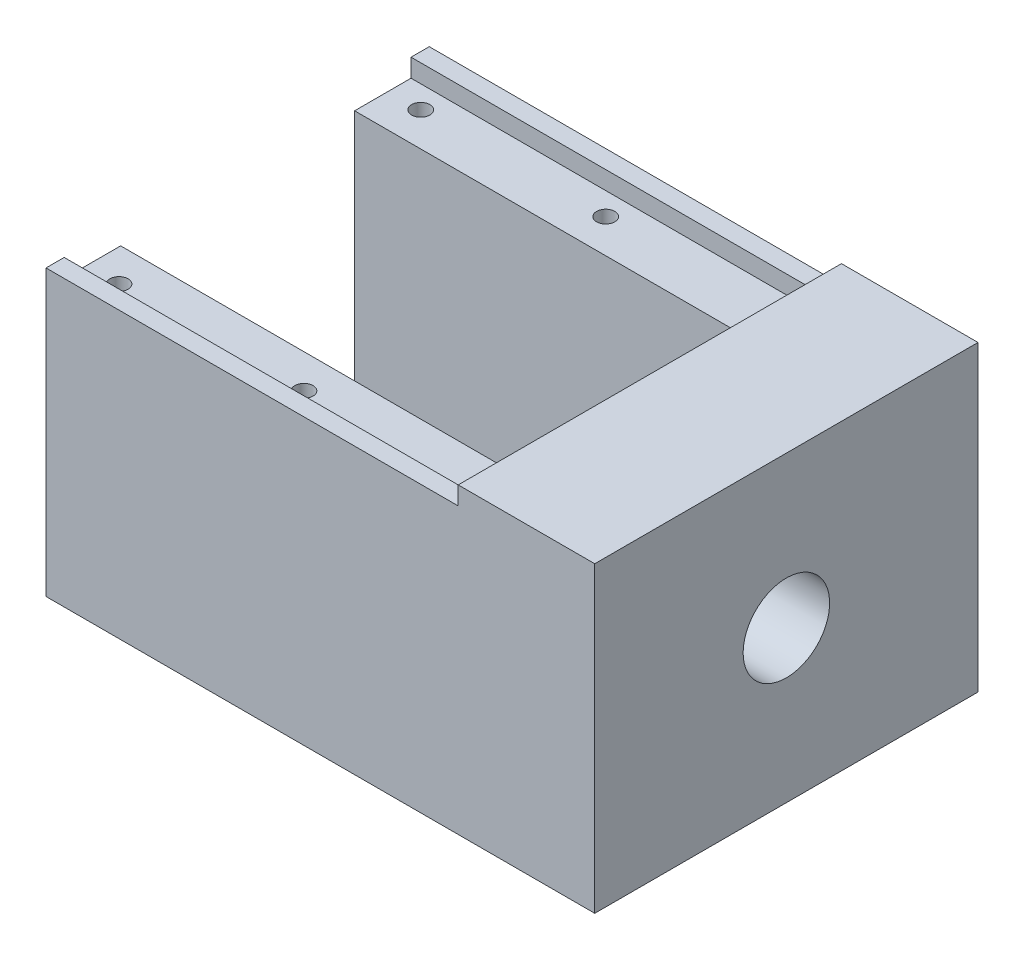
ISO-10303-21;
HEADER;
FILE_DESCRIPTION(('STEP AP214'),'2;1');
FILE_NAME('part.step','',(''),(''),'','','');
FILE_SCHEMA(('AUTOMOTIVE_DESIGN { 1 0 10303 214 1 1 1 1 }'));
ENDSEC;
DATA;
#1=APPLICATION_CONTEXT('core data for automotive mechanical design processes');
#2=APPLICATION_PROTOCOL_DEFINITION('international standard','automotive_design',2000,#1);
#3=PRODUCT_CONTEXT('',#1,'mechanical');
#4=PRODUCT('Part','Part','',(#3));
#5=PRODUCT_RELATED_PRODUCT_CATEGORY('part','',(#4));
#6=PRODUCT_DEFINITION_FORMATION('','',#4);
#7=PRODUCT_DEFINITION_CONTEXT('part definition',#1,'design');
#8=PRODUCT_DEFINITION('design','',#6,#7);
#9=PRODUCT_DEFINITION_SHAPE('','',#8);
#10=(LENGTH_UNIT() NAMED_UNIT(*) SI_UNIT(.MILLI.,.METRE.));
#11=(NAMED_UNIT(*) PLANE_ANGLE_UNIT() SI_UNIT($,.RADIAN.));
#12=(NAMED_UNIT(*) SI_UNIT($,.STERADIAN.) SOLID_ANGLE_UNIT());
#13=UNCERTAINTY_MEASURE_WITH_UNIT(LENGTH_MEASURE(1.E-05),#10,'distance_accuracy_value','');
#14=(GEOMETRIC_REPRESENTATION_CONTEXT(3) GLOBAL_UNCERTAINTY_ASSIGNED_CONTEXT((#13)) GLOBAL_UNIT_ASSIGNED_CONTEXT((#10,
#11,#12)) REPRESENTATION_CONTEXT('',''));
#15=CARTESIAN_POINT('',(0.,0.,0.));
#16=DIRECTION('',(0.,0.,1.));
#17=DIRECTION('',(1.,0.,0.));
#18=AXIS2_PLACEMENT_3D('',#15,#16,#17);
#19=CARTESIAN_POINT('',(44.28,33.26,0.));
#20=DIRECTION('',(1.,0.,0.));
#21=DIRECTION('',(0.,0.,-1.));
#22=AXIS2_PLACEMENT_3D('',#19,#20,#21);
#23=PLANE('',#22);
#24=CARTESIAN_POINT('',(44.28,16.5567913684883,-19.05));
#25=DIRECTION('',(-1.,0.,0.));
#26=DIRECTION('',(0.,0.,1.));
#27=AXIS2_PLACEMENT_3D('',#24,#25,#26);
#28=CIRCLE('',#27,4.80769230769231);
#29=CARTESIAN_POINT('',(44.28,12.7176015942887,-21.9438775376862));
#30=VERTEX_POINT('',#29);
#31=EDGE_CURVE('E369',#30,#30,#28,.T.);
#32=ORIENTED_EDGE('',*,*,#31,.F.);
#33=EDGE_LOOP('',(#32));
#34=FACE_BOUND('',#33,.T.);
#35=DIRECTION('',(0.,0.,1.));
#36=VECTOR('',#35,1.);
#37=CARTESIAN_POINT('',(44.28,9.71683602771352,-26.05));
#38=LINE('',#37,#36);
#39=CARTESIAN_POINT('',(44.28,9.71683602771352,-26.05));
#40=VERTEX_POINT('',#39);
#41=CARTESIAN_POINT('',(44.28,9.71683602771352,-12.05));
#42=VERTEX_POINT('',#41);
#43=EDGE_CURVE('E65',#40,#42,#38,.T.);
#44=ORIENTED_EDGE('',*,*,#43,.T.);
#45=DIRECTION('',(0.,1.,0.));
#46=VECTOR('',#45,1.);
#47=CARTESIAN_POINT('',(44.28,23.7168360277135,-12.05));
#48=LINE('',#47,#46);
#49=CARTESIAN_POINT('',(44.28,23.7168360277135,-12.05));
#50=VERTEX_POINT('',#49);
#51=EDGE_CURVE('E202',#42,#50,#48,.T.);
#52=ORIENTED_EDGE('',*,*,#51,.T.);
#53=DIRECTION('',(0.,0.,-1.));
#54=VECTOR('',#53,1.);
#55=CARTESIAN_POINT('',(44.28,23.7168360277135,-26.05));
#56=LINE('',#55,#54);
#57=CARTESIAN_POINT('',(44.28,23.7168360277135,-26.05));
#58=VERTEX_POINT('',#57);
#59=EDGE_CURVE('E208',#50,#58,#56,.T.);
#60=ORIENTED_EDGE('',*,*,#59,.T.);
#61=DIRECTION('',(0.,-1.,0.));
#62=VECTOR('',#61,1.);
#63=CARTESIAN_POINT('',(44.28,23.7168360277135,-26.05));
#64=LINE('',#63,#62);
#65=EDGE_CURVE('E212',#58,#40,#64,.T.);
#66=ORIENTED_EDGE('',*,*,#65,.T.);
#67=EDGE_LOOP('',(#44,#52,#60,#66));
#68=FACE_BOUND('',#67,.T.);
#69=ADVANCED_FACE('F46',(#34,#68),#23,.F.);
#70=CARTESIAN_POINT('',(0.,33.26,0.));
#71=DIRECTION('',(0.,1.,0.));
#72=DIRECTION('',(0.,0.,1.));
#73=AXIS2_PLACEMENT_3D('',#70,#71,#72);
#74=PLANE('',#73);
#75=DIRECTION('',(0.,0.,1.));
#76=VECTOR('',#75,1.);
#77=CARTESIAN_POINT('',(44.28,33.26,0.));
#78=LINE('',#77,#76);
#79=CARTESIAN_POINT('',(44.28,33.26,-40.1));
#80=VERTEX_POINT('',#79);
#81=CARTESIAN_POINT('',(44.28,33.26,2.));
#82=VERTEX_POINT('',#81);
#83=EDGE_CURVE('E389',#80,#82,#78,.T.);
#84=ORIENTED_EDGE('',*,*,#83,.T.);
#85=DIRECTION('',(-1.,0.,0.));
#86=VECTOR('',#85,1.);
#87=CARTESIAN_POINT('',(59.28,33.26,2.));
#88=LINE('',#87,#86);
#89=CARTESIAN_POINT('',(59.28,33.26,2.));
#90=VERTEX_POINT('',#89);
#91=EDGE_CURVE('E324',#90,#82,#88,.T.);
#92=ORIENTED_EDGE('',*,*,#91,.F.);
#93=DIRECTION('',(0.,0.,-1.));
#94=VECTOR('',#93,1.);
#95=CARTESIAN_POINT('',(59.28,33.26,0.));
#96=LINE('',#95,#94);
#97=CARTESIAN_POINT('',(59.28,33.26,-40.1));
#98=VERTEX_POINT('',#97);
#99=EDGE_CURVE('E386',#90,#98,#96,.T.);
#100=ORIENTED_EDGE('',*,*,#99,.T.);
#101=DIRECTION('',(1.,0.,0.));
#102=VECTOR('',#101,1.);
#103=CARTESIAN_POINT('',(59.28,33.26,-40.1));
#104=LINE('',#103,#102);
#105=EDGE_CURVE('E316',#80,#98,#104,.T.);
#106=ORIENTED_EDGE('',*,*,#105,.F.);
#107=EDGE_LOOP('',(#84,#92,#100,#106));
#108=FACE_BOUND('',#107,.T.);
#109=ADVANCED_FACE('F421',(#108),#74,.T.);
#110=CARTESIAN_POINT('',(0.,0.,2.));
#111=DIRECTION('',(0.,0.,1.));
#112=DIRECTION('',(1.,0.,0.));
#113=AXIS2_PLACEMENT_3D('',#110,#111,#112);
#114=PLANE('',#113);
#115=ORIENTED_EDGE('',*,*,#91,.T.);
#116=DIRECTION('',(0.,1.,0.));
#117=VECTOR('',#116,1.);
#118=CARTESIAN_POINT('',(44.28,31.26,2.));
#119=LINE('',#118,#117);
#120=CARTESIAN_POINT('',(44.28,31.26,2.));
#121=VERTEX_POINT('',#120);
#122=EDGE_CURVE('E301',#121,#82,#119,.T.);
#123=ORIENTED_EDGE('',*,*,#122,.F.);
#124=DIRECTION('',(1.,0.,0.));
#125=VECTOR('',#124,1.);
#126=CARTESIAN_POINT('',(0.,31.26,2.));
#127=LINE('',#126,#125);
#128=CARTESIAN_POINT('',(-1.,31.26,2.));
#129=VERTEX_POINT('',#128);
#130=EDGE_CURVE('E293',#129,#121,#127,.T.);
#131=ORIENTED_EDGE('',*,*,#130,.F.);
#132=DIRECTION('',(0.,1.,0.));
#133=VECTOR('',#132,1.);
#134=CARTESIAN_POINT('',(-1.,31.26,2.));
#135=LINE('',#134,#133);
#136=CARTESIAN_POINT('',(-1.,0.,2.));
#137=VERTEX_POINT('',#136);
#138=EDGE_CURVE('E262',#137,#129,#135,.T.);
#139=ORIENTED_EDGE('',*,*,#138,.F.);
#140=DIRECTION('',(1.,0.,0.));
#141=VECTOR('',#140,1.);
#142=CARTESIAN_POINT('',(0.,0.,2.));
#143=LINE('',#142,#141);
#144=CARTESIAN_POINT('',(59.28,0.,2.));
#145=VERTEX_POINT('',#144);
#146=EDGE_CURVE('E318',#137,#145,#143,.T.);
#147=ORIENTED_EDGE('',*,*,#146,.T.);
#148=DIRECTION('',(0.,1.,0.));
#149=VECTOR('',#148,1.);
#150=CARTESIAN_POINT('',(59.28,29.26,2.));
#151=LINE('',#150,#149);
#152=EDGE_CURVE('E321',#145,#90,#151,.T.);
#153=ORIENTED_EDGE('',*,*,#152,.T.);
#154=EDGE_LOOP('',(#115,#123,#131,#139,#147,#153));
#155=FACE_BOUND('',#154,.T.);
#156=ADVANCED_FACE('F437',(#155),#114,.T.);
#157=CARTESIAN_POINT('',(0.,0.,-38.1));
#158=DIRECTION('',(0.,0.,1.));
#159=DIRECTION('',(1.,0.,0.));
#160=AXIS2_PLACEMENT_3D('',#157,#158,#159);
#161=PLANE('',#160);
#162=DIRECTION('',(0.,-1.,0.));
#163=VECTOR('',#162,1.);
#164=CARTESIAN_POINT('',(44.28,33.26,-38.1));
#165=LINE('',#164,#163);
#166=CARTESIAN_POINT('',(44.28,31.26,-38.1));
#167=VERTEX_POINT('',#166);
#168=CARTESIAN_POINT('',(44.28,29.26,-38.1));
#169=VERTEX_POINT('',#168);
#170=EDGE_CURVE('E396',#167,#169,#165,.T.);
#171=ORIENTED_EDGE('',*,*,#170,.F.);
#172=DIRECTION('',(-1.,0.,0.));
#173=VECTOR('',#172,1.);
#174=CARTESIAN_POINT('',(44.28,31.26,-38.1));
#175=LINE('',#174,#173);
#176=CARTESIAN_POINT('',(-1.,31.26,-38.1));
#177=VERTEX_POINT('',#176);
#178=EDGE_CURVE('E307',#167,#177,#175,.T.);
#179=ORIENTED_EDGE('',*,*,#178,.T.);
#180=DIRECTION('',(0.,1.,0.));
#181=VECTOR('',#180,1.);
#182=CARTESIAN_POINT('',(-1.,31.26,-38.1));
#183=LINE('',#182,#181);
#184=CARTESIAN_POINT('',(-1.,29.26,-38.1));
#185=VERTEX_POINT('',#184);
#186=EDGE_CURVE('E286',#185,#177,#183,.T.);
#187=ORIENTED_EDGE('',*,*,#186,.F.);
#188=DIRECTION('',(-1.,0.,0.));
#189=VECTOR('',#188,1.);
#190=CARTESIAN_POINT('',(0.,29.26,-38.1));
#191=LINE('',#190,#189);
#192=EDGE_CURVE('E13',#169,#185,#191,.T.);
#193=ORIENTED_EDGE('',*,*,#192,.F.);
#194=EDGE_LOOP('',(#171,#179,#187,#193));
#195=FACE_BOUND('',#194,.T.);
#196=ADVANCED_FACE('F442',(#195),#161,.T.);
#197=CARTESIAN_POINT('',(0.,29.26,0.));
#198=DIRECTION('',(0.,-1.,0.));
#199=DIRECTION('',(0.,0.,-1.));
#200=AXIS2_PLACEMENT_3D('',#197,#198,#199);
#201=PLANE('',#200);
#202=CARTESIAN_POINT('',(22.86,29.26,-35.625));
#203=DIRECTION('',(0.,1.,0.));
#204=DIRECTION('',(0.,0.,1.));
#205=AXIS2_PLACEMENT_3D('',#202,#203,#204);
#206=CIRCLE('',#205,0.99999999999999);
#207=CARTESIAN_POINT('',(22.86,29.26,-34.625));
#208=VERTEX_POINT('',#207);
#209=EDGE_CURVE('E231',#208,#208,#206,.T.);
#210=ORIENTED_EDGE('',*,*,#209,.F.);
#211=EDGE_LOOP('',(#210));
#212=FACE_BOUND('',#211,.T.);
#213=CARTESIAN_POINT('',(2.54,29.26,-35.625));
#214=DIRECTION('',(0.,1.,0.));
#215=DIRECTION('',(0.,0.,1.));
#216=AXIS2_PLACEMENT_3D('',#213,#214,#215);
#217=CIRCLE('',#216,0.999999999999989);
#218=CARTESIAN_POINT('',(2.54,29.26,-34.625));
#219=VERTEX_POINT('',#218);
#220=EDGE_CURVE('E238',#219,#219,#217,.T.);
#221=ORIENTED_EDGE('',*,*,#220,.F.);
#222=EDGE_LOOP('',(#221));
#223=FACE_BOUND('',#222,.T.);
#224=DIRECTION('',(1.,0.,0.));
#225=VECTOR('',#224,1.);
#226=CARTESIAN_POINT('',(0.,29.26,-31.9));
#227=LINE('',#226,#225);
#228=CARTESIAN_POINT('',(-1.,29.26,-31.9));
#229=VERTEX_POINT('',#228);
#230=CARTESIAN_POINT('',(44.28,29.26,-31.9));
#231=VERTEX_POINT('',#230);
#232=EDGE_CURVE('E380',#229,#231,#227,.T.);
#233=ORIENTED_EDGE('',*,*,#232,.T.);
#234=DIRECTION('',(0.,0.,1.));
#235=VECTOR('',#234,1.);
#236=CARTESIAN_POINT('',(44.28,29.26,0.));
#237=LINE('',#236,#235);
#238=EDGE_CURVE('E390',#169,#231,#237,.T.);
#239=ORIENTED_EDGE('',*,*,#238,.F.);
#240=ORIENTED_EDGE('',*,*,#192,.T.);
#241=DIRECTION('',(0.,0.,-1.));
#242=VECTOR('',#241,1.);
#243=CARTESIAN_POINT('',(-1.,29.26,-38.1));
#244=LINE('',#243,#242);
#245=EDGE_CURVE('E283',#229,#185,#244,.T.);
#246=ORIENTED_EDGE('',*,*,#245,.F.);
#247=EDGE_LOOP('',(#233,#239,#240,#246));
#248=FACE_BOUND('',#247,.T.);
#249=ADVANCED_FACE('F425',(#212,#223,#248),#201,.F.);
#250=CARTESIAN_POINT('',(2.54,29.26,-2.475));
#251=DIRECTION('',(0.,1.,0.));
#252=DIRECTION('',(0.,0.,1.));
#253=AXIS2_PLACEMENT_3D('',#250,#251,#252);
#254=CIRCLE('',#253,0.999999999999989);
#255=CARTESIAN_POINT('',(2.54,29.26,-1.47500000000001));
#256=VERTEX_POINT('',#255);
#257=EDGE_CURVE('E244',#256,#256,#254,.T.);
#258=ORIENTED_EDGE('',*,*,#257,.F.);
#259=EDGE_LOOP('',(#258));
#260=FACE_BOUND('',#259,.T.);
#261=CARTESIAN_POINT('',(22.86,29.26,-2.475));
#262=DIRECTION('',(0.,1.,0.));
#263=DIRECTION('',(0.,0.,1.));
#264=AXIS2_PLACEMENT_3D('',#261,#262,#263);
#265=CIRCLE('',#264,0.99999999999999);
#266=CARTESIAN_POINT('',(22.86,29.26,-1.47500000000001));
#267=VERTEX_POINT('',#266);
#268=EDGE_CURVE('E250',#267,#267,#265,.T.);
#269=ORIENTED_EDGE('',*,*,#268,.F.);
#270=EDGE_LOOP('',(#269));
#271=FACE_BOUND('',#270,.T.);
#272=CARTESIAN_POINT('',(44.28,29.26,-6.2));
#273=VERTEX_POINT('',#272);
#274=CARTESIAN_POINT('',(44.28,29.26,0.));
#275=VERTEX_POINT('',#274);
#276=EDGE_CURVE('E383',#273,#275,#237,.T.);
#277=ORIENTED_EDGE('',*,*,#276,.F.);
#278=DIRECTION('',(1.,0.,0.));
#279=VECTOR('',#278,1.);
#280=CARTESIAN_POINT('',(0.,29.26,-6.2));
#281=LINE('',#280,#279);
#282=CARTESIAN_POINT('',(-1.,29.26,-6.2));
#283=VERTEX_POINT('',#282);
#284=EDGE_CURVE('E376',#283,#273,#281,.T.);
#285=ORIENTED_EDGE('',*,*,#284,.F.);
#286=DIRECTION('',(0.,0.,-1.));
#287=VECTOR('',#286,1.);
#288=CARTESIAN_POINT('',(-1.,29.26,-6.2));
#289=LINE('',#288,#287);
#290=CARTESIAN_POINT('',(-1.,29.26,0.));
#291=VERTEX_POINT('',#290);
#292=EDGE_CURVE('E271',#291,#283,#289,.T.);
#293=ORIENTED_EDGE('',*,*,#292,.F.);
#294=DIRECTION('',(1.,0.,0.));
#295=VECTOR('',#294,1.);
#296=CARTESIAN_POINT('',(0.,29.26,0.));
#297=LINE('',#296,#295);
#298=EDGE_CURVE('E57',#291,#275,#297,.T.);
#299=ORIENTED_EDGE('',*,*,#298,.T.);
#300=EDGE_LOOP('',(#277,#285,#293,#299));
#301=FACE_BOUND('',#300,.T.);
#302=ADVANCED_FACE('F423',(#260,#271,#301),#201,.F.);
#303=CARTESIAN_POINT('',(59.28,29.26,0.));
#304=DIRECTION('',(-1.,0.,0.));
#305=DIRECTION('',(0.,0.,1.));
#306=AXIS2_PLACEMENT_3D('',#303,#304,#305);
#307=PLANE('',#306);
#308=CARTESIAN_POINT('',(59.28,16.63,-19.05));
#309=DIRECTION('',(1.,0.,0.));
#310=DIRECTION('',(0.,0.,-1.));
#311=AXIS2_PLACEMENT_3D('',#308,#309,#310);
#312=CIRCLE('',#311,4.75);
#313=CARTESIAN_POINT('',(59.28,12.8243420285123,-21.8924403958662));
#314=VERTEX_POINT('',#313);
#315=EDGE_CURVE('E327',#314,#314,#312,.T.);
#316=ORIENTED_EDGE('',*,*,#315,.F.);
#317=EDGE_LOOP('',(#316));
#318=FACE_BOUND('',#317,.T.);
#319=DIRECTION('',(0.,0.,-1.));
#320=VECTOR('',#319,1.);
#321=CARTESIAN_POINT('',(59.28,0.,0.));
#322=LINE('',#321,#320);
#323=CARTESIAN_POINT('',(59.28,0.,-40.1));
#324=VERTEX_POINT('',#323);
#325=EDGE_CURVE('E398',#145,#324,#322,.T.);
#326=ORIENTED_EDGE('',*,*,#325,.T.);
#327=DIRECTION('',(0.,-1.,0.));
#328=VECTOR('',#327,1.);
#329=CARTESIAN_POINT('',(59.28,0.,-40.1));
#330=LINE('',#329,#328);
#331=EDGE_CURVE('E304',#98,#324,#330,.T.);
#332=ORIENTED_EDGE('',*,*,#331,.F.);
#333=ORIENTED_EDGE('',*,*,#99,.F.);
#334=ORIENTED_EDGE('',*,*,#152,.F.);
#335=EDGE_LOOP('',(#326,#332,#333,#334));
#336=FACE_BOUND('',#335,.T.);
#337=ADVANCED_FACE('F48',(#318,#336),#307,.F.);
#338=CARTESIAN_POINT('',(0.,0.,0.));
#339=DIRECTION('',(0.,-1.,0.));
#340=DIRECTION('',(0.,0.,-1.));
#341=AXIS2_PLACEMENT_3D('',#338,#339,#340);
#342=PLANE('',#341);
#343=ORIENTED_EDGE('',*,*,#146,.F.);
#344=DIRECTION('',(0.,0.,1.));
#345=VECTOR('',#344,1.);
#346=CARTESIAN_POINT('',(-1.,0.,2.));
#347=LINE('',#346,#345);
#348=CARTESIAN_POINT('',(-1.,0.,-40.1));
#349=VERTEX_POINT('',#348);
#350=EDGE_CURVE('E259',#349,#137,#347,.T.);
#351=ORIENTED_EDGE('',*,*,#350,.F.);
#352=DIRECTION('',(-1.,0.,0.));
#353=VECTOR('',#352,1.);
#354=CARTESIAN_POINT('',(59.28,0.,-40.1));
#355=LINE('',#354,#353);
#356=EDGE_CURVE('E314',#324,#349,#355,.T.);
#357=ORIENTED_EDGE('',*,*,#356,.F.);
#358=ORIENTED_EDGE('',*,*,#325,.F.);
#359=EDGE_LOOP('',(#343,#351,#357,#358));
#360=FACE_BOUND('',#359,.T.);
#361=ADVANCED_FACE('F419',(#360),#342,.T.);
#362=ORIENTED_EDGE('',*,*,#238,.T.);
#363=DIRECTION('',(0.,0.,-1.));
#364=VECTOR('',#363,1.);
#365=CARTESIAN_POINT('',(44.28,29.26,-31.9));
#366=LINE('',#365,#364);
#367=EDGE_CURVE('E220',#273,#231,#366,.T.);
#368=ORIENTED_EDGE('',*,*,#367,.F.);
#369=ORIENTED_EDGE('',*,*,#276,.T.);
#370=DIRECTION('',(0.,-1.,0.));
#371=VECTOR('',#370,1.);
#372=CARTESIAN_POINT('',(44.28,33.26,0.));
#373=LINE('',#372,#371);
#374=CARTESIAN_POINT('',(44.28,31.26,0.));
#375=VERTEX_POINT('',#374);
#376=EDGE_CURVE('E392',#375,#275,#373,.T.);
#377=ORIENTED_EDGE('',*,*,#376,.F.);
#378=DIRECTION('',(0.,0.,1.));
#379=VECTOR('',#378,1.);
#380=CARTESIAN_POINT('',(44.28,31.26,0.));
#381=LINE('',#380,#379);
#382=EDGE_CURVE('E296',#375,#121,#381,.T.);
#383=ORIENTED_EDGE('',*,*,#382,.T.);
#384=ORIENTED_EDGE('',*,*,#122,.T.);
#385=ORIENTED_EDGE('',*,*,#83,.F.);
#386=DIRECTION('',(0.,1.,0.));
#387=VECTOR('',#386,1.);
#388=CARTESIAN_POINT('',(44.28,31.26,-40.1));
#389=LINE('',#388,#387);
#390=CARTESIAN_POINT('',(44.28,31.26,-40.1));
#391=VERTEX_POINT('',#390);
#392=EDGE_CURVE('E292',#391,#80,#389,.T.);
#393=ORIENTED_EDGE('',*,*,#392,.F.);
#394=DIRECTION('',(0.,0.,-1.));
#395=VECTOR('',#394,1.);
#396=CARTESIAN_POINT('',(44.28,31.26,-38.1));
#397=LINE('',#396,#395);
#398=EDGE_CURVE('E73',#167,#391,#397,.T.);
#399=ORIENTED_EDGE('',*,*,#398,.F.);
#400=ORIENTED_EDGE('',*,*,#170,.T.);
#401=EDGE_LOOP('',(#362,#368,#369,#377,#383,#384,#385,#393,#399,#400));
#402=FACE_BOUND('',#401,.T.);
#403=ADVANCED_FACE('F408',(#402),#23,.F.);
#404=CARTESIAN_POINT('',(0.,2.,0.));
#405=DIRECTION('',(0.,-1.,0.));
#406=DIRECTION('',(0.,0.,-1.));
#407=AXIS2_PLACEMENT_3D('',#404,#405,#406);
#408=PLANE('',#407);
#409=DIRECTION('',(1.,0.,0.));
#410=VECTOR('',#409,1.);
#411=CARTESIAN_POINT('',(0.,2.,-6.2));
#412=LINE('',#411,#410);
#413=CARTESIAN_POINT('',(-1.,2.,-6.2));
#414=VERTEX_POINT('',#413);
#415=CARTESIAN_POINT('',(55.28,2.,-6.2));
#416=VERTEX_POINT('',#415);
#417=EDGE_CURVE('E379',#414,#416,#412,.T.);
#418=ORIENTED_EDGE('',*,*,#417,.T.);
#419=DIRECTION('',(0.,0.,-1.));
#420=VECTOR('',#419,1.);
#421=CARTESIAN_POINT('',(55.28,2.,-31.9));
#422=LINE('',#421,#420);
#423=CARTESIAN_POINT('',(55.28,2.,-31.9));
#424=VERTEX_POINT('',#423);
#425=EDGE_CURVE('E230',#416,#424,#422,.T.);
#426=ORIENTED_EDGE('',*,*,#425,.T.);
#427=DIRECTION('',(1.,0.,0.));
#428=VECTOR('',#427,1.);
#429=CARTESIAN_POINT('',(0.,2.,-31.9));
#430=LINE('',#429,#428);
#431=CARTESIAN_POINT('',(-1.,2.,-31.9));
#432=VERTEX_POINT('',#431);
#433=EDGE_CURVE('E373',#432,#424,#430,.T.);
#434=ORIENTED_EDGE('',*,*,#433,.F.);
#435=DIRECTION('',(0.,0.,-1.));
#436=VECTOR('',#435,1.);
#437=CARTESIAN_POINT('',(-1.,2.,-31.9));
#438=LINE('',#437,#436);
#439=EDGE_CURVE('E277',#414,#432,#438,.T.);
#440=ORIENTED_EDGE('',*,*,#439,.F.);
#441=EDGE_LOOP('',(#418,#426,#434,#440));
#442=FACE_BOUND('',#441,.T.);
#443=ADVANCED_FACE('F418',(#442),#408,.F.);
#444=CARTESIAN_POINT('',(0.,-51.197738231293,-6.2));
#445=DIRECTION('',(0.,0.,1.));
#446=DIRECTION('',(1.,0.,0.));
#447=AXIS2_PLACEMENT_3D('',#444,#445,#446);
#448=PLANE('',#447);
#449=ORIENTED_EDGE('',*,*,#417,.F.);
#450=DIRECTION('',(0.,-1.,0.));
#451=VECTOR('',#450,1.);
#452=CARTESIAN_POINT('',(-1.,2.,-6.2));
#453=LINE('',#452,#451);
#454=EDGE_CURVE('E274',#283,#414,#453,.T.);
#455=ORIENTED_EDGE('',*,*,#454,.F.);
#456=ORIENTED_EDGE('',*,*,#284,.T.);
#457=DIRECTION('',(-1.,0.,0.));
#458=VECTOR('',#457,1.);
#459=CARTESIAN_POINT('',(96.7446179748306,29.26,-6.2));
#460=LINE('',#459,#458);
#461=CARTESIAN_POINT('',(55.28,29.26,-6.2));
#462=VERTEX_POINT('',#461);
#463=EDGE_CURVE('E225',#462,#273,#460,.T.);
#464=ORIENTED_EDGE('',*,*,#463,.F.);
#465=DIRECTION('',(0.,-1.,0.));
#466=VECTOR('',#465,1.);
#467=CARTESIAN_POINT('',(55.28,2.,-6.2));
#468=LINE('',#467,#466);
#469=EDGE_CURVE('E713',#462,#416,#468,.T.);
#470=ORIENTED_EDGE('',*,*,#469,.T.);
#471=EDGE_LOOP('',(#449,#455,#456,#464,#470));
#472=FACE_BOUND('',#471,.T.);
#473=ADVANCED_FACE('F473',(#472),#448,.F.);
#474=CARTESIAN_POINT('',(0.,-51.197738231293,-31.9));
#475=DIRECTION('',(0.,0.,1.));
#476=DIRECTION('',(1.,0.,0.));
#477=AXIS2_PLACEMENT_3D('',#474,#475,#476);
#478=PLANE('',#477);
#479=ORIENTED_EDGE('',*,*,#433,.T.);
#480=DIRECTION('',(0.,1.,0.));
#481=VECTOR('',#480,1.);
#482=CARTESIAN_POINT('',(55.28,29.26,-31.9));
#483=LINE('',#482,#481);
#484=CARTESIAN_POINT('',(55.28,29.26,-31.9));
#485=VERTEX_POINT('',#484);
#486=EDGE_CURVE('E235',#424,#485,#483,.T.);
#487=ORIENTED_EDGE('',*,*,#486,.T.);
#488=DIRECTION('',(-1.,0.,0.));
#489=VECTOR('',#488,1.);
#490=CARTESIAN_POINT('',(96.7446179748306,29.26,-31.9));
#491=LINE('',#490,#489);
#492=EDGE_CURVE('E224',#485,#231,#491,.T.);
#493=ORIENTED_EDGE('',*,*,#492,.T.);
#494=ORIENTED_EDGE('',*,*,#232,.F.);
#495=DIRECTION('',(0.,1.,0.));
#496=VECTOR('',#495,1.);
#497=CARTESIAN_POINT('',(-1.,29.26,-31.9));
#498=LINE('',#497,#496);
#499=EDGE_CURVE('E280',#432,#229,#498,.T.);
#500=ORIENTED_EDGE('',*,*,#499,.F.);
#501=EDGE_LOOP('',(#479,#487,#493,#494,#500));
#502=FACE_BOUND('',#501,.T.);
#503=ADVANCED_FACE('F351',(#502),#478,.T.);
#504=CARTESIAN_POINT('',(59.28,12.8243420285123,-21.8924403958662));
#505=CARTESIAN_POINT('',(44.28,12.7176015942887,-21.9438775376862));
#506=CARTESIAN_POINT('',(59.28,12.5874719955234,-21.5753022315755));
#507=CARTESIAN_POINT('',(44.28,12.4764451328148,-21.6239450565029));
#508=CARTESIAN_POINT('',(59.28,12.3580886149842,-21.1877521441185));
#509=CARTESIAN_POINT('',(44.28,12.2425527333075,-21.2327128080731));
#510=CARTESIAN_POINT('',(59.28,12.0919832473018,-20.4758617499632));
#511=CARTESIAN_POINT('',(44.28,11.970048845403,-20.5133675450677));
#512=CARTESIAN_POINT('',(59.28,12.0167948920325,-20.2169879816995));
#513=CARTESIAN_POINT('',(44.28,11.8927955957453,-20.2516868064103));
#514=CARTESIAN_POINT('',(59.28,11.9104452617248,-19.6577214740595));
#515=CARTESIAN_POINT('',(44.28,11.7826656602037,-19.6861064929405));
#516=CARTESIAN_POINT('',(59.28,11.8793798875435,-19.357223574781));
#517=CARTESIAN_POINT('',(44.28,11.7498855708922,-19.3821000550939));
#518=CARTESIAN_POINT('',(59.28,11.8806388830368,-18.7238914928196));
#519=CARTESIAN_POINT('',(44.28,11.7483404821416,-18.7410762761644));
#520=CARTESIAN_POINT('',(59.28,11.9131515634346,-18.3910068208695));
#521=CARTESIAN_POINT('',(44.28,11.7797658539972,-18.4040069947878));
#522=CARTESIAN_POINT('',(59.28,12.0590181789202,-17.7124438796717));
#523=CARTESIAN_POINT('',(44.28,11.9243819861486,-17.7165596963892));
#524=CARTESIAN_POINT('',(59.28,12.1726104488741,-17.3668567614358));
#525=CARTESIAN_POINT('',(44.28,12.037814379504,-17.3662728756042));
#526=CARTESIAN_POINT('',(59.28,12.4895225264324,-16.6925142496952));
#527=CARTESIAN_POINT('',(44.28,12.3555705623091,-16.6823357936305));
#528=CARTESIAN_POINT('',(59.28,12.6930002660217,-16.3640303128292));
#529=CARTESIAN_POINT('',(44.28,12.5600554088257,-16.3489595804119));
#530=CARTESIAN_POINT('',(59.28,13.1834836575669,-15.7582033527134));
#531=CARTESIAN_POINT('',(44.28,13.0537943662609,-15.7335968758466));
#532=CARTESIAN_POINT('',(59.28,13.4704214398432,-15.4812120615011));
#533=CARTESIAN_POINT('',(44.28,13.3429813496188,-15.4519666872742));
#534=CARTESIAN_POINT('',(59.28,14.1046977684245,-15.0074719955234));
#535=CARTESIAN_POINT('',(44.28,13.9828463119854,-14.9696537643265));
#536=CARTESIAN_POINT('',(59.28,14.4517360655798,-14.8109474764105));
#537=CARTESIAN_POINT('',(44.28,14.3332213963374,-14.7691993437609));
#538=CARTESIAN_POINT('',(59.28,15.1718572453197,-14.5125756455099));
#539=CARTESIAN_POINT('',(44.28,15.0607536948843,-14.4640007676989));
#540=CARTESIAN_POINT('',(59.28,15.5445835969693,-14.4106935858856));
#541=CARTESIAN_POINT('',(44.28,15.4375498966147,-14.3592230298133));
#542=CARTESIAN_POINT('',(59.28,16.2811408540788,-14.2982013859678));
#543=CARTESIAN_POINT('',(44.28,16.1825452083977,-14.2420867449533));
#544=CARTESIAN_POINT('',(59.28,16.6447562888057,-14.2873627646428));
#545=CARTESIAN_POINT('',(44.28,16.550525215659,-14.2294979033081));
#546=CARTESIAN_POINT('',(59.28,17.3368152415716,-14.3400803193736));
#547=CARTESIAN_POINT('',(44.28,17.2512176470393,-14.2797744421736));
#548=CARTESIAN_POINT('',(59.28,17.6652389996981,-14.4033820911031));
#549=CARTESIAN_POINT('',(44.2800000000001,17.5839089389251,-14.3423824188814));
#550=CARTESIAN_POINT('',(59.28,18.2728852796429,-14.5819237097258));
#551=CARTESIAN_POINT('',(44.28,18.1997243915476,-14.5203857917811));
#552=CARTESIAN_POINT('',(59.28,18.5522096598875,-14.6969973189712));
#553=CARTESIAN_POINT('',(44.28,18.4829509068311,-14.6356124794354));
#554=CARTESIAN_POINT('',(59.28,19.0582951104549,-14.9577017246846));
#555=CARTESIAN_POINT('',(44.28,18.9963387507345,-14.8972278754257));
#556=CARTESIAN_POINT('',(59.28,19.2851842344765,-15.1032704097234));
#557=CARTESIAN_POINT('',(44.28,19.2266294106103,-15.0435531485025));
#558=CARTESIAN_POINT('',(59.28,19.8922765564042,-15.5604781444091));
#559=CARTESIAN_POINT('',(44.28,19.843124702283,-15.5036069841312));
#560=CARTESIAN_POINT('',(59.28,20.1987879384989,-15.8904214398432));
#561=CARTESIAN_POINT('',(44.28,20.1548246812141,-15.8361899811305));
#562=CARTESIAN_POINT('',(59.28,20.6725280044766,-16.5246977684245));
#563=CARTESIAN_POINT('',(44.28,20.6371376041618,-16.4760549434971));
#564=CARTESIAN_POINT('',(59.28,20.9019113850158,-16.9122478558815));
#565=CARTESIAN_POINT('',(44.28,20.8710300036692,-16.8672871919269));
#566=CARTESIAN_POINT('',(59.28,21.1680167526982,-17.6241382500368));
#567=CARTESIAN_POINT('',(44.28,21.1435338915736,-17.5866324549323));
#568=CARTESIAN_POINT('',(59.28,21.2432051079675,-17.8830120183005));
#569=CARTESIAN_POINT('',(44.28,21.2207871412314,-17.8483131935897));
#570=CARTESIAN_POINT('',(59.28,21.3495547382752,-18.4422785259406));
#571=CARTESIAN_POINT('',(44.28,21.330917076773,-18.4138935070595));
#572=CARTESIAN_POINT('',(59.28,21.3806201124565,-18.7427764252191));
#573=CARTESIAN_POINT('',(44.28,21.3636971660845,-18.7178999449061));
#574=CARTESIAN_POINT('',(59.28,21.3793611169633,-19.3761085071804));
#575=CARTESIAN_POINT('',(44.28,21.365242254835,-19.3589237238356));
#576=CARTESIAN_POINT('',(59.28,21.3468484365654,-19.7089931791305));
#577=CARTESIAN_POINT('',(44.28,21.3338168829794,-19.6959930052122));
#578=CARTESIAN_POINT('',(59.28,21.2009818210798,-20.3875561203284));
#579=CARTESIAN_POINT('',(44.28,21.189200750828,-20.3834403036108));
#580=CARTESIAN_POINT('',(59.2800000000001,21.0873895511259,-20.7331432385642));
#581=CARTESIAN_POINT('',(44.28,21.0757683574727,-20.7337271243958));
#582=CARTESIAN_POINT('',(59.28,20.7704774735676,-21.4074857503049));
#583=CARTESIAN_POINT('',(44.28,20.7580121746675,-21.4176642063695));
#584=CARTESIAN_POINT('',(59.28,20.5669997339783,-21.7359696871709));
#585=CARTESIAN_POINT('',(44.28,20.5535273281509,-21.7510404195881));
#586=CARTESIAN_POINT('',(59.28,20.0765163424331,-22.3417966472867));
#587=CARTESIAN_POINT('',(44.28,20.0597883707157,-22.3664031241534));
#588=CARTESIAN_POINT('',(59.28,19.7895785601568,-22.6187879384989));
#589=CARTESIAN_POINT('',(44.28,19.7706013873578,-22.6480333127258));
#590=CARTESIAN_POINT('',(59.28,19.1553022315755,-23.0925280044766));
#591=CARTESIAN_POINT('',(44.28,19.1307364249912,-23.1303462356735));
#592=CARTESIAN_POINT('',(59.28,18.8082639344202,-23.2890525235895));
#593=CARTESIAN_POINT('',(44.28,18.7803613406392,-23.3308006562391));
#594=CARTESIAN_POINT('',(59.28,18.0881427546803,-23.5874243544901));
#595=CARTESIAN_POINT('',(44.28,18.0528290420924,-23.6359992323011));
#596=CARTESIAN_POINT('',(59.28,17.7154164030307,-23.6893064141144));
#597=CARTESIAN_POINT('',(44.28,17.6760328403619,-23.7407769701868));
#598=CARTESIAN_POINT('',(59.28,16.9788591459212,-23.8017986140322));
#599=CARTESIAN_POINT('',(44.28,16.9310375285789,-23.8579132550467));
#600=CARTESIAN_POINT('',(59.28,16.6152437111943,-23.8126372353572));
#601=CARTESIAN_POINT('',(44.28,16.5630575213176,-23.8705020966919));
#602=CARTESIAN_POINT('',(59.28,15.9231847584284,-23.7599196806264));
#603=CARTESIAN_POINT('',(44.28,15.8623650899373,-23.8202255578264));
#604=CARTESIAN_POINT('',(59.28,15.5947610003019,-23.696617908897));
#605=CARTESIAN_POINT('',(44.28,15.5296737980516,-23.7576175811186));
#606=CARTESIAN_POINT('',(59.28,14.9871147203571,-23.5180762902742));
#607=CARTESIAN_POINT('',(44.28,14.9138583454291,-23.5796142082189));
#608=CARTESIAN_POINT('',(59.28,14.7077903401125,-23.4030026810288));
#609=CARTESIAN_POINT('',(44.28,14.6306318301455,-23.4643875205646));
#610=CARTESIAN_POINT('',(59.28,14.2017048895451,-23.1422982753154));
#611=CARTESIAN_POINT('',(44.28,14.1172439862421,-23.2027721245743));
#612=CARTESIAN_POINT('',(59.28,13.9748157655235,-22.9967295902767));
#613=CARTESIAN_POINT('',(44.28,13.8869533263664,-23.0564468514976));
#614=CARTESIAN_POINT('',(59.28,13.3677234435958,-22.539521855591));
#615=CARTESIAN_POINT('',(44.28,13.2704580346936,-22.5963930158688));
#616=CARTESIAN_POINT('',(59.28,13.0612120615011,-22.2095785601568));
#617=CARTESIAN_POINT('',(44.28,12.9587580557625,-22.2638100188695));
#618=CARTESIAN_POINT('',(59.28,12.8243420285123,-21.8924403958662));
#619=CARTESIAN_POINT('',(44.28,12.7176015942887,-21.9438775376862));
#620=B_SPLINE_SURFACE_WITH_KNOTS('',3,1,((#504,#505),(#506,#507),(#508,#509),(#510,#511),(#512,
#513),(#514,#515),(#516,#517),(#518,#519),(#520,#521),(#522,#523),(#524,#525),(#526,#527),(#528,
#529),(#530,#531),(#532,#533),(#534,#535),(#536,#537),(#538,#539),(#540,#541),(#542,#543),(#544,
#545),(#546,#547),(#548,#549),(#550,#551),(#552,#553),(#554,#555),(#556,#557),(#558,#559),(#560,
#561),(#562,#563),(#564,#565),(#566,#567),(#568,#569),(#570,#571),(#572,#573),(#574,#575),(#576,
#577),(#578,#579),(#580,#581),(#582,#583),(#584,#585),(#586,#587),(#588,#589),(#590,#591),(#592,
#593),(#594,#595),(#596,#597),(#598,#599),(#600,#601),(#602,#603),(#604,#605),(#606,#607),(#608,
#609),(#610,#611),(#612,#613),(#614,#615),(#616,#617),(#618,#619)),.UNSPECIFIED.,.T.,.F.,.F.,(4,
2,2,2,2,2,2,2,2,2,2,2,2,2,2,2,2,2,2,2,2,2,2,2,2,2,2,2,4),(2,2),(0.,0.0624999999999995,
0.0937499999999993,0.124999999999999,0.156249999999999,0.187499999999999,0.218749999999999,
0.249999999999999,0.281249999999999,0.312499999999999,0.343749999999999,0.374999999999998,
0.406249999999998,0.437499999999998,0.499999999999998,0.562499999999998,0.593749999999998,
0.624999999999998,0.656249999999999,0.687499999999999,0.718749999999999,0.749999999999999,
0.781249999999999,0.812499999999999,0.84375,0.875,0.90625,0.9375,1.),(0.,1.),.UNSPECIFIED.);
#621=CARTESIAN_POINT('',(59.28,12.8243420285123,-21.8924403958662));
#622=CARTESIAN_POINT('',(59.12375,12.8232301489891,-21.8929761994268));
#623=CARTESIAN_POINT('',(58.9675,12.8221182694659,-21.8935120029874));
#624=CARTESIAN_POINT('',(58.655,12.8198945104196,-21.8945836101087));
#625=CARTESIAN_POINT('',(58.49875,12.8187826308964,-21.8951194136693));
#626=CARTESIAN_POINT('',(58.18625,12.8165588718501,-21.8961910207905));
#627=CARTESIAN_POINT('',(58.03,12.815446992327,-21.8967268243512));
#628=CARTESIAN_POINT('',(57.7175,12.8132232332806,-21.8977984314724));
#629=CARTESIAN_POINT('',(57.56125,12.8121113537575,-21.8983342350331));
#630=CARTESIAN_POINT('',(57.24875,12.8098875947111,-21.8994058421543));
#631=CARTESIAN_POINT('',(57.0925,12.808775715188,-21.8999416457149));
#632=CARTESIAN_POINT('',(56.78,12.8065519561417,-21.9010132528362));
#633=CARTESIAN_POINT('',(56.62375,12.8054400766185,-21.9015490563968));
#634=CARTESIAN_POINT('',(56.31125,12.8032163175722,-21.9026206635181));
#635=CARTESIAN_POINT('',(56.155,12.802104438049,-21.9031564670787));
#636=CARTESIAN_POINT('',(55.8425,12.7998806790027,-21.9042280741999));
#637=CARTESIAN_POINT('',(55.68625,12.7987687994795,-21.9047638777606));
#638=CARTESIAN_POINT('',(55.37375,12.7965450404332,-21.9058354848818));
#639=CARTESIAN_POINT('',(55.2175,12.79543316091,-21.9063712884424));
#640=CARTESIAN_POINT('',(54.905,12.7932094018637,-21.9074428955637));
#641=CARTESIAN_POINT('',(54.74875,12.7920975223405,-21.9079786991243));
#642=CARTESIAN_POINT('',(54.43625,12.7898737632942,-21.9090503062456));
#643=CARTESIAN_POINT('',(54.28,12.7887618837711,-21.9095861098062));
#644=CARTESIAN_POINT('',(53.9675,12.7865381247247,-21.9106577169274));
#645=CARTESIAN_POINT('',(53.81125,12.7854262452016,-21.9111935204881));
#646=CARTESIAN_POINT('',(53.49875,12.7832024861553,-21.9122651276093));
#647=CARTESIAN_POINT('',(53.3425,12.7820906066321,-21.9128009311699));
#648=CARTESIAN_POINT('',(53.03,12.7798668475858,-21.9138725382912));
#649=CARTESIAN_POINT('',(52.87375,12.7787549680626,-21.9144083418518));
#650=CARTESIAN_POINT('',(52.56125,12.7765312090163,-21.9154799489731));
#651=CARTESIAN_POINT('',(52.405,12.7754193294931,-21.9160157525337));
#652=CARTESIAN_POINT('',(52.0925,12.7731955704468,-21.9170873596549));
#653=CARTESIAN_POINT('',(51.93625,12.7720836909236,-21.9176231632156));
#654=CARTESIAN_POINT('',(51.62375,12.7698599318773,-21.9186947703368));
#655=CARTESIAN_POINT('',(51.4675,12.7687480523541,-21.9192305738974));
#656=CARTESIAN_POINT('',(51.155,12.7665242933078,-21.9203021810187));
#657=CARTESIAN_POINT('',(50.99875,12.7654124137847,-21.9208379845793));
#658=CARTESIAN_POINT('',(50.68625,12.7631886547383,-21.9219095917006));
#659=CARTESIAN_POINT('',(50.53,12.7620767752152,-21.9224453952612));
#660=CARTESIAN_POINT('',(50.2175,12.7598530161688,-21.9235170023824));
#661=CARTESIAN_POINT('',(50.06125,12.7587411366457,-21.9240528059431));
#662=CARTESIAN_POINT('',(49.74875,12.7565173775994,-21.9251244130643));
#663=CARTESIAN_POINT('',(49.5925,12.7554054980762,-21.9256602166249));
#664=CARTESIAN_POINT('',(49.28,12.7531817390299,-21.9267318237462));
#665=CARTESIAN_POINT('',(49.12375,12.7520698595067,-21.9272676273068));
#666=CARTESIAN_POINT('',(48.81125,12.7498461004604,-21.9283392344281));
#667=CARTESIAN_POINT('',(48.655,12.7487342209372,-21.9288750379887));
#668=CARTESIAN_POINT('',(48.3425,12.7465104618909,-21.9299466451099));
#669=CARTESIAN_POINT('',(48.18625,12.7453985823677,-21.9304824486706));
#670=CARTESIAN_POINT('',(47.87375,12.7431748233214,-21.9315540557918));
#671=CARTESIAN_POINT('',(47.7175,12.7420629437982,-21.9320898593524));
#672=CARTESIAN_POINT('',(47.405,12.7398391847519,-21.9331614664737));
#673=CARTESIAN_POINT('',(47.24875,12.7387273052288,-21.9336972700343));
#674=CARTESIAN_POINT('',(46.93625,12.7365035461824,-21.9347688771556));
#675=CARTESIAN_POINT('',(46.78,12.7353916666593,-21.9353046807162));
#676=CARTESIAN_POINT('',(46.4675,12.7331679076129,-21.9363762878374));
#677=CARTESIAN_POINT('',(46.31125,12.7320560280898,-21.9369120913981));
#678=CARTESIAN_POINT('',(45.99875,12.7298322690435,-21.9379836985193));
#679=CARTESIAN_POINT('',(45.8425,12.7287203895203,-21.9385195020799));
#680=CARTESIAN_POINT('',(45.53,12.726496630474,-21.9395911092012));
#681=CARTESIAN_POINT('',(45.37375,12.7253847509508,-21.9401269127618));
#682=CARTESIAN_POINT('',(45.06125,12.7231609919045,-21.9411985198831));
#683=CARTESIAN_POINT('',(44.905,12.7220491123813,-21.9417343234437));
#684=CARTESIAN_POINT('',(44.5925,12.719825353335,-21.9428059305649));
#685=CARTESIAN_POINT('',(44.43625,12.7187134738118,-21.9433417341256));
#686=CARTESIAN_POINT('',(44.28,12.7176015942887,-21.9438775376862));
#687=B_SPLINE_CURVE_WITH_KNOTS('',3,(#621,#622,#623,#624,#625,#626,#627,#628,#629,#630,#631,
#632,#633,#634,#635,#636,#637,#638,#639,#640,#641,#642,#643,#644,#645,#646,#647,#648,#649,#650,
#651,#652,#653,#654,#655,#656,#657,#658,#659,#660,#661,#662,#663,#664,#665,#666,#667,#668,#669,
#670,#671,#672,#673,#674,#675,#676,#677,#678,#679,#680,#681,#682,#683,#684,#685,#686),
.UNSPECIFIED.,.F.,.F.,(4,2,2,2,2,2,2,2,2,2,2,2,2,2,2,2,2,2,2,2,2,2,2,2,2,2,2,2,2,2,2,2,4),(0.,
0.468764624042561,0.937529248085129,1.40629387212769,1.87505849617026,2.34382312021282,
2.81258774425539,3.28135236829795,3.75011699234052,4.21888161638308,4.68764624042564,
5.15641086446821,5.62517548851077,6.09394011255333,6.5627047365959,7.03146936063846,
7.50023398468103,7.96899860872359,8.43776323276615,8.90652785680872,9.37529248085129,
9.84405710489385,10.3128217289364,10.781586352979,11.2503509770215,11.7191156010641,
12.1878802251067,12.6566448491492,13.1254094731918,13.5941740972344,14.0629387212769,
14.5317033453195,15.000467969362),.UNSPECIFIED.);
#688=EDGE_CURVE('',#314,#30,#687,.T.);
#689=ORIENTED_EDGE('',*,*,#315,.T.);
#690=ORIENTED_EDGE('',*,*,#31,.T.);
#691=ORIENTED_EDGE('',*,*,#688,.T.);
#692=ORIENTED_EDGE('',*,*,#688,.F.);
#693=EDGE_LOOP('',(#689,#691,#690,#692));
#694=FACE_BOUND('',#693,.T.);
#695=ADVANCED_FACE('F338',(#694),#620,.F.);
#696=CARTESIAN_POINT('',(0.,0.,0.));
#697=DIRECTION('',(0.,0.,1.));
#698=DIRECTION('',(1.,0.,0.));
#699=AXIS2_PLACEMENT_3D('',#696,#697,#698);
#700=PLANE('',#699);
#701=ORIENTED_EDGE('',*,*,#298,.F.);
#702=DIRECTION('',(0.,-1.,0.));
#703=VECTOR('',#702,1.);
#704=CARTESIAN_POINT('',(-1.,29.26,0.));
#705=LINE('',#704,#703);
#706=CARTESIAN_POINT('',(-1.,31.26,0.));
#707=VERTEX_POINT('',#706);
#708=EDGE_CURVE('E268',#707,#291,#705,.T.);
#709=ORIENTED_EDGE('',*,*,#708,.F.);
#710=DIRECTION('',(1.,0.,0.));
#711=VECTOR('',#710,1.);
#712=CARTESIAN_POINT('',(0.,31.26,0.));
#713=LINE('',#712,#711);
#714=EDGE_CURVE('E298',#707,#375,#713,.T.);
#715=ORIENTED_EDGE('',*,*,#714,.T.);
#716=ORIENTED_EDGE('',*,*,#376,.T.);
#717=EDGE_LOOP('',(#701,#709,#715,#716));
#718=FACE_BOUND('',#717,.T.);
#719=ADVANCED_FACE('F350',(#718),#700,.F.);
#720=CARTESIAN_POINT('',(0.,0.,-40.1));
#721=DIRECTION('',(0.,0.,1.));
#722=DIRECTION('',(1.,0.,0.));
#723=AXIS2_PLACEMENT_3D('',#720,#721,#722);
#724=PLANE('',#723);
#725=DIRECTION('',(-1.,0.,0.));
#726=VECTOR('',#725,1.);
#727=CARTESIAN_POINT('',(44.28,31.26,-40.1));
#728=LINE('',#727,#726);
#729=CARTESIAN_POINT('',(-1.,31.26,-40.1));
#730=VERTEX_POINT('',#729);
#731=EDGE_CURVE('E309',#391,#730,#728,.T.);
#732=ORIENTED_EDGE('',*,*,#731,.F.);
#733=ORIENTED_EDGE('',*,*,#392,.T.);
#734=ORIENTED_EDGE('',*,*,#105,.T.);
#735=ORIENTED_EDGE('',*,*,#331,.T.);
#736=ORIENTED_EDGE('',*,*,#356,.T.);
#737=DIRECTION('',(0.,-1.,0.));
#738=VECTOR('',#737,1.);
#739=CARTESIAN_POINT('',(-1.,0.,-40.1));
#740=LINE('',#739,#738);
#741=EDGE_CURVE('E256',#730,#349,#740,.T.);
#742=ORIENTED_EDGE('',*,*,#741,.F.);
#743=EDGE_LOOP('',(#732,#733,#734,#735,#736,#742));
#744=FACE_BOUND('',#743,.T.);
#745=ADVANCED_FACE('F455',(#744),#724,.F.);
#746=CARTESIAN_POINT('',(0.,31.26,0.));
#747=DIRECTION('',(0.,1.,0.));
#748=DIRECTION('',(0.,0.,1.));
#749=AXIS2_PLACEMENT_3D('',#746,#747,#748);
#750=PLANE('',#749);
#751=ORIENTED_EDGE('',*,*,#398,.T.);
#752=ORIENTED_EDGE('',*,*,#731,.T.);
#753=DIRECTION('',(0.,0.,-1.));
#754=VECTOR('',#753,1.);
#755=CARTESIAN_POINT('',(-1.,31.26,-40.1));
#756=LINE('',#755,#754);
#757=EDGE_CURVE('E289',#177,#730,#756,.T.);
#758=ORIENTED_EDGE('',*,*,#757,.F.);
#759=ORIENTED_EDGE('',*,*,#178,.F.);
#760=EDGE_LOOP('',(#751,#752,#758,#759));
#761=FACE_BOUND('',#760,.T.);
#762=ADVANCED_FACE('F485',(#761),#750,.T.);
#763=CARTESIAN_POINT('',(0.,31.26,0.));
#764=DIRECTION('',(0.,-1.,0.));
#765=DIRECTION('',(0.,0.,-1.));
#766=AXIS2_PLACEMENT_3D('',#763,#764,#765);
#767=PLANE('',#766);
#768=ORIENTED_EDGE('',*,*,#130,.T.);
#769=ORIENTED_EDGE('',*,*,#382,.F.);
#770=ORIENTED_EDGE('',*,*,#714,.F.);
#771=DIRECTION('',(0.,0.,-1.));
#772=VECTOR('',#771,1.);
#773=CARTESIAN_POINT('',(-1.,31.26,0.));
#774=LINE('',#773,#772);
#775=EDGE_CURVE('E265',#129,#707,#774,.T.);
#776=ORIENTED_EDGE('',*,*,#775,.F.);
#777=EDGE_LOOP('',(#768,#769,#770,#776));
#778=FACE_BOUND('',#777,.T.);
#779=ADVANCED_FACE('F483',(#778),#767,.F.);
#780=CARTESIAN_POINT('',(-1.,0.,0.));
#781=DIRECTION('',(1.,0.,0.));
#782=DIRECTION('',(0.,0.,-1.));
#783=AXIS2_PLACEMENT_3D('',#780,#781,#782);
#784=PLANE('',#783);
#785=ORIENTED_EDGE('',*,*,#741,.T.);
#786=ORIENTED_EDGE('',*,*,#350,.T.);
#787=ORIENTED_EDGE('',*,*,#138,.T.);
#788=ORIENTED_EDGE('',*,*,#775,.T.);
#789=ORIENTED_EDGE('',*,*,#708,.T.);
#790=ORIENTED_EDGE('',*,*,#292,.T.);
#791=ORIENTED_EDGE('',*,*,#454,.T.);
#792=ORIENTED_EDGE('',*,*,#439,.T.);
#793=ORIENTED_EDGE('',*,*,#499,.T.);
#794=ORIENTED_EDGE('',*,*,#245,.T.);
#795=ORIENTED_EDGE('',*,*,#186,.T.);
#796=ORIENTED_EDGE('',*,*,#757,.T.);
#797=EDGE_LOOP('',(#785,#786,#787,#788,#789,#790,#791,#792,#793,#794,#795,#796));
#798=FACE_BOUND('',#797,.T.);
#799=ADVANCED_FACE('F480',(#798),#784,.F.);
#800=CARTESIAN_POINT('',(22.86,9.26,-2.475));
#801=DIRECTION('',(0.,1.,0.));
#802=DIRECTION('',(0.,0.,1.));
#803=AXIS2_PLACEMENT_3D('',#800,#801,#802);
#804=CONICAL_SURFACE('',#803,0.999999999999987,1.02974425867665);
#805=CARTESIAN_POINT('',(22.86,8.65913938097244,-2.475));
#806=VERTEX_POINT('',#805);
#807=VERTEX_LOOP('',#806);
#808=FACE_BOUND('',#807,.T.);
#809=CARTESIAN_POINT('',(22.86,9.26,-2.475));
#810=DIRECTION('',(0.,1.,0.));
#811=DIRECTION('',(0.,0.,1.));
#812=AXIS2_PLACEMENT_3D('',#809,#810,#811);
#813=CIRCLE('',#812,0.999999999999987);
#814=CARTESIAN_POINT('',(22.86,9.26,-1.47500000000001));
#815=VERTEX_POINT('',#814);
#816=EDGE_CURVE('E253',#815,#815,#813,.T.);
#817=ORIENTED_EDGE('',*,*,#816,.T.);
#818=EDGE_LOOP('',(#817));
#819=FACE_BOUND('',#818,.T.);
#820=ADVANCED_FACE('F491',(#808,#819),#804,.F.);
#821=CARTESIAN_POINT('',(22.86,29.26,-2.475));
#822=DIRECTION('',(0.,1.,0.));
#823=DIRECTION('',(0.,0.,1.));
#824=AXIS2_PLACEMENT_3D('',#821,#822,#823);
#825=CYLINDRICAL_SURFACE('',#824,0.999999999999989);
#826=ORIENTED_EDGE('',*,*,#816,.F.);
#827=EDGE_LOOP('',(#826));
#828=FACE_BOUND('',#827,.T.);
#829=ORIENTED_EDGE('',*,*,#268,.T.);
#830=EDGE_LOOP('',(#829));
#831=FACE_BOUND('',#830,.T.);
#832=ADVANCED_FACE('F534',(#828,#831),#825,.F.);
#833=CARTESIAN_POINT('',(2.54,9.26,-2.475));
#834=DIRECTION('',(0.,1.,0.));
#835=DIRECTION('',(0.,0.,1.));
#836=AXIS2_PLACEMENT_3D('',#833,#834,#835);
#837=CONICAL_SURFACE('',#836,0.999999999999986,1.02974425867665);
#838=CARTESIAN_POINT('',(2.54,8.65913938097244,-2.475));
#839=VERTEX_POINT('',#838);
#840=VERTEX_LOOP('',#839);
#841=FACE_BOUND('',#840,.T.);
#842=CARTESIAN_POINT('',(2.54,9.26,-2.475));
#843=DIRECTION('',(0.,1.,0.));
#844=DIRECTION('',(0.,0.,1.));
#845=AXIS2_PLACEMENT_3D('',#842,#843,#844);
#846=CIRCLE('',#845,0.999999999999986);
#847=CARTESIAN_POINT('',(2.54,9.26,-1.47500000000001));
#848=VERTEX_POINT('',#847);
#849=EDGE_CURVE('E247',#848,#848,#846,.T.);
#850=ORIENTED_EDGE('',*,*,#849,.T.);
#851=EDGE_LOOP('',(#850));
#852=FACE_BOUND('',#851,.T.);
#853=ADVANCED_FACE('F530',(#841,#852),#837,.F.);
#854=CARTESIAN_POINT('',(2.54,29.26,-2.475));
#855=DIRECTION('',(0.,1.,0.));
#856=DIRECTION('',(0.,0.,1.));
#857=AXIS2_PLACEMENT_3D('',#854,#855,#856);
#858=CYLINDRICAL_SURFACE('',#857,0.999999999999987);
#859=ORIENTED_EDGE('',*,*,#849,.F.);
#860=EDGE_LOOP('',(#859));
#861=FACE_BOUND('',#860,.T.);
#862=ORIENTED_EDGE('',*,*,#257,.T.);
#863=EDGE_LOOP('',(#862));
#864=FACE_BOUND('',#863,.T.);
#865=ADVANCED_FACE('F522',(#861,#864),#858,.F.);
#866=CARTESIAN_POINT('',(2.54,9.26,-35.625));
#867=DIRECTION('',(0.,1.,0.));
#868=DIRECTION('',(0.,0.,1.));
#869=AXIS2_PLACEMENT_3D('',#866,#867,#868);
#870=CONICAL_SURFACE('',#869,0.999999999999986,1.02974425867665);
#871=CARTESIAN_POINT('',(2.54,8.65913938097244,-35.625));
#872=VERTEX_POINT('',#871);
#873=VERTEX_LOOP('',#872);
#874=FACE_BOUND('',#873,.T.);
#875=CARTESIAN_POINT('',(2.54,9.26,-35.625));
#876=DIRECTION('',(0.,1.,0.));
#877=DIRECTION('',(0.,0.,1.));
#878=AXIS2_PLACEMENT_3D('',#875,#876,#877);
#879=CIRCLE('',#878,0.999999999999986);
#880=CARTESIAN_POINT('',(2.54,9.26,-34.625));
#881=VERTEX_POINT('',#880);
#882=EDGE_CURVE('E241',#881,#881,#879,.T.);
#883=ORIENTED_EDGE('',*,*,#882,.T.);
#884=EDGE_LOOP('',(#883));
#885=FACE_BOUND('',#884,.T.);
#886=ADVANCED_FACE('F512',(#874,#885),#870,.F.);
#887=CARTESIAN_POINT('',(2.54,29.26,-35.625));
#888=DIRECTION('',(0.,1.,0.));
#889=DIRECTION('',(0.,0.,1.));
#890=AXIS2_PLACEMENT_3D('',#887,#888,#889);
#891=CYLINDRICAL_SURFACE('',#890,0.999999999999987);
#892=ORIENTED_EDGE('',*,*,#882,.F.);
#893=EDGE_LOOP('',(#892));
#894=FACE_BOUND('',#893,.T.);
#895=ORIENTED_EDGE('',*,*,#220,.T.);
#896=EDGE_LOOP('',(#895));
#897=FACE_BOUND('',#896,.T.);
#898=ADVANCED_FACE('F509',(#894,#897),#891,.F.);
#899=CARTESIAN_POINT('',(22.86,9.26,-35.625));
#900=DIRECTION('',(0.,1.,0.));
#901=DIRECTION('',(0.,0.,1.));
#902=AXIS2_PLACEMENT_3D('',#899,#900,#901);
#903=CONICAL_SURFACE('',#902,0.999999999999987,1.02974425867665);
#904=CARTESIAN_POINT('',(22.86,8.65913938097244,-35.625));
#905=VERTEX_POINT('',#904);
#906=VERTEX_LOOP('',#905);
#907=FACE_BOUND('',#906,.T.);
#908=CARTESIAN_POINT('',(22.86,9.26,-35.625));
#909=DIRECTION('',(0.,1.,0.));
#910=DIRECTION('',(0.,0.,1.));
#911=AXIS2_PLACEMENT_3D('',#908,#909,#910);
#912=CIRCLE('',#911,0.999999999999987);
#913=CARTESIAN_POINT('',(22.86,9.26,-34.625));
#914=VERTEX_POINT('',#913);
#915=EDGE_CURVE('E234',#914,#914,#912,.T.);
#916=ORIENTED_EDGE('',*,*,#915,.T.);
#917=EDGE_LOOP('',(#916));
#918=FACE_BOUND('',#917,.T.);
#919=ADVANCED_FACE('F511',(#907,#918),#903,.F.);
#920=CARTESIAN_POINT('',(22.86,29.26,-35.625));
#921=DIRECTION('',(0.,1.,0.));
#922=DIRECTION('',(0.,0.,1.));
#923=AXIS2_PLACEMENT_3D('',#920,#921,#922);
#924=CYLINDRICAL_SURFACE('',#923,0.999999999999989);
#925=ORIENTED_EDGE('',*,*,#915,.F.);
#926=EDGE_LOOP('',(#925));
#927=FACE_BOUND('',#926,.T.);
#928=ORIENTED_EDGE('',*,*,#209,.T.);
#929=EDGE_LOOP('',(#928));
#930=FACE_BOUND('',#929,.T.);
#931=ADVANCED_FACE('F519',(#927,#930),#924,.F.);
#932=CARTESIAN_POINT('',(96.7446179748306,29.26,-31.9));
#933=DIRECTION('',(0.,1.,0.));
#934=DIRECTION('',(0.,0.,1.));
#935=AXIS2_PLACEMENT_3D('',#932,#933,#934);
#936=PLANE('',#935);
#937=DIRECTION('',(0.,0.,1.));
#938=VECTOR('',#937,1.);
#939=CARTESIAN_POINT('',(55.28,29.26,-31.9));
#940=LINE('',#939,#938);
#941=EDGE_CURVE('E700',#485,#462,#940,.T.);
#942=ORIENTED_EDGE('',*,*,#941,.T.);
#943=ORIENTED_EDGE('',*,*,#463,.T.);
#944=ORIENTED_EDGE('',*,*,#367,.T.);
#945=ORIENTED_EDGE('',*,*,#492,.F.);
#946=EDGE_LOOP('',(#942,#943,#944,#945));
#947=FACE_BOUND('',#946,.T.);
#948=ADVANCED_FACE('F583',(#947),#936,.F.);
#949=CARTESIAN_POINT('',(96.7446179748306,9.71683602771352,-26.05));
#950=DIRECTION('',(0.,-1.,0.));
#951=DIRECTION('',(0.,0.,-1.));
#952=AXIS2_PLACEMENT_3D('',#949,#950,#951);
#953=PLANE('',#952);
#954=DIRECTION('',(-1.,0.,0.));
#955=VECTOR('',#954,1.);
#956=CARTESIAN_POINT('',(96.7446179748306,9.71683602771352,-12.05));
#957=LINE('',#956,#955);
#958=CARTESIAN_POINT('',(55.28,9.71683602771352,-12.05));
#959=VERTEX_POINT('',#958);
#960=EDGE_CURVE('E191',#959,#42,#957,.T.);
#961=ORIENTED_EDGE('',*,*,#960,.T.);
#962=ORIENTED_EDGE('',*,*,#43,.F.);
#963=DIRECTION('',(-1.,0.,0.));
#964=VECTOR('',#963,1.);
#965=CARTESIAN_POINT('',(96.7446179748306,9.71683602771352,-26.05));
#966=LINE('',#965,#964);
#967=CARTESIAN_POINT('',(55.28,9.71683602771352,-26.05));
#968=VERTEX_POINT('',#967);
#969=EDGE_CURVE('E199',#968,#40,#966,.T.);
#970=ORIENTED_EDGE('',*,*,#969,.F.);
#971=DIRECTION('',(0.,0.,-1.));
#972=VECTOR('',#971,1.);
#973=CARTESIAN_POINT('',(55.28,9.71683602771352,-26.05));
#974=LINE('',#973,#972);
#975=EDGE_CURVE('E195',#959,#968,#974,.T.);
#976=ORIENTED_EDGE('',*,*,#975,.F.);
#977=EDGE_LOOP('',(#961,#962,#970,#976));
#978=FACE_BOUND('',#977,.T.);
#979=ADVANCED_FACE('F193',(#978),#953,.T.);
#980=CARTESIAN_POINT('',(96.7446179748306,23.7168360277135,-12.05));
#981=DIRECTION('',(0.,0.,1.));
#982=DIRECTION('',(0.,-1.,0.));
#983=AXIS2_PLACEMENT_3D('',#980,#981,#982);
#984=PLANE('',#983);
#985=DIRECTION('',(-1.,0.,0.));
#986=VECTOR('',#985,1.);
#987=CARTESIAN_POINT('',(96.7446179748306,23.7168360277135,-12.05));
#988=LINE('',#987,#986);
#989=CARTESIAN_POINT('',(55.28,23.7168360277135,-12.05));
#990=VERTEX_POINT('',#989);
#991=EDGE_CURVE('E198',#990,#50,#988,.T.);
#992=ORIENTED_EDGE('',*,*,#991,.T.);
#993=ORIENTED_EDGE('',*,*,#51,.F.);
#994=ORIENTED_EDGE('',*,*,#960,.F.);
#995=DIRECTION('',(0.,-1.,0.));
#996=VECTOR('',#995,1.);
#997=CARTESIAN_POINT('',(55.28,23.7168360277135,-12.05));
#998=LINE('',#997,#996);
#999=EDGE_CURVE('E704',#990,#959,#998,.T.);
#1000=ORIENTED_EDGE('',*,*,#999,.F.);
#1001=EDGE_LOOP('',(#992,#993,#994,#1000));
#1002=FACE_BOUND('',#1001,.T.);
#1003=ADVANCED_FACE('F203',(#1002),#984,.T.);
#1004=CARTESIAN_POINT('',(96.7446179748306,23.7168360277135,-26.05));
#1005=DIRECTION('',(0.,1.,0.));
#1006=DIRECTION('',(0.,0.,1.));
#1007=AXIS2_PLACEMENT_3D('',#1004,#1005,#1006);
#1008=PLANE('',#1007);
#1009=DIRECTION('',(-1.,0.,0.));
#1010=VECTOR('',#1009,1.);
#1011=CARTESIAN_POINT('',(96.7446179748306,23.7168360277135,-26.05));
#1012=LINE('',#1011,#1010);
#1013=CARTESIAN_POINT('',(55.28,23.7168360277135,-26.05));
#1014=VERTEX_POINT('',#1013);
#1015=EDGE_CURVE('E218',#1014,#58,#1012,.T.);
#1016=ORIENTED_EDGE('',*,*,#1015,.T.);
#1017=ORIENTED_EDGE('',*,*,#59,.F.);
#1018=ORIENTED_EDGE('',*,*,#991,.F.);
#1019=DIRECTION('',(0.,0.,1.));
#1020=VECTOR('',#1019,1.);
#1021=CARTESIAN_POINT('',(55.28,23.7168360277135,-26.05));
#1022=LINE('',#1021,#1020);
#1023=EDGE_CURVE('E705',#1014,#990,#1022,.T.);
#1024=ORIENTED_EDGE('',*,*,#1023,.F.);
#1025=EDGE_LOOP('',(#1016,#1017,#1018,#1024));
#1026=FACE_BOUND('',#1025,.T.);
#1027=ADVANCED_FACE('F663',(#1026),#1008,.T.);
#1028=CARTESIAN_POINT('',(96.7446179748306,23.7168360277135,-26.05));
#1029=DIRECTION('',(0.,0.,-1.));
#1030=DIRECTION('',(0.,1.,0.));
#1031=AXIS2_PLACEMENT_3D('',#1028,#1029,#1030);
#1032=PLANE('',#1031);
#1033=ORIENTED_EDGE('',*,*,#969,.T.);
#1034=ORIENTED_EDGE('',*,*,#65,.F.);
#1035=ORIENTED_EDGE('',*,*,#1015,.F.);
#1036=DIRECTION('',(0.,1.,0.));
#1037=VECTOR('',#1036,1.);
#1038=CARTESIAN_POINT('',(55.28,23.7168360277135,-26.05));
#1039=LINE('',#1038,#1037);
#1040=EDGE_CURVE('E703',#968,#1014,#1039,.T.);
#1041=ORIENTED_EDGE('',*,*,#1040,.F.);
#1042=EDGE_LOOP('',(#1033,#1034,#1035,#1041));
#1043=FACE_BOUND('',#1042,.T.);
#1044=ADVANCED_FACE('F672',(#1043),#1032,.T.);
#1045=CARTESIAN_POINT('',(55.28,29.26,0.));
#1046=DIRECTION('',(-1.,0.,0.));
#1047=DIRECTION('',(0.,0.,1.));
#1048=AXIS2_PLACEMENT_3D('',#1045,#1046,#1047);
#1049=PLANE('',#1048);
#1050=ORIENTED_EDGE('',*,*,#941,.F.);
#1051=ORIENTED_EDGE('',*,*,#486,.F.);
#1052=ORIENTED_EDGE('',*,*,#425,.F.);
#1053=ORIENTED_EDGE('',*,*,#469,.F.);
#1054=EDGE_LOOP('',(#1050,#1051,#1052,#1053));
#1055=FACE_BOUND('',#1054,.T.);
#1056=ORIENTED_EDGE('',*,*,#975,.T.);
#1057=ORIENTED_EDGE('',*,*,#1040,.T.);
#1058=ORIENTED_EDGE('',*,*,#1023,.T.);
#1059=ORIENTED_EDGE('',*,*,#999,.T.);
#1060=EDGE_LOOP('',(#1056,#1057,#1058,#1059));
#1061=FACE_BOUND('',#1060,.T.);
#1062=ADVANCED_FACE('F682',(#1055,#1061),#1049,.T.);
#1063=CLOSED_SHELL('',(#69,#109,#156,#196,#249,#302,#337,#361,#403,#443,#473,#503,#695,#719,
#745,#762,#779,#799,#820,#832,#853,#865,#886,#898,#919,#931,#948,#979,#1003,#1027,#1044,#1062));
#1064=MANIFOLD_SOLID_BREP('B2',#1063);
#1065=ADVANCED_BREP_SHAPE_REPRESENTATION('',(#18,#1064),#14);
#1066=SHAPE_DEFINITION_REPRESENTATION(#9,#1065);
ENDSEC;
END-ISO-10303-21;
